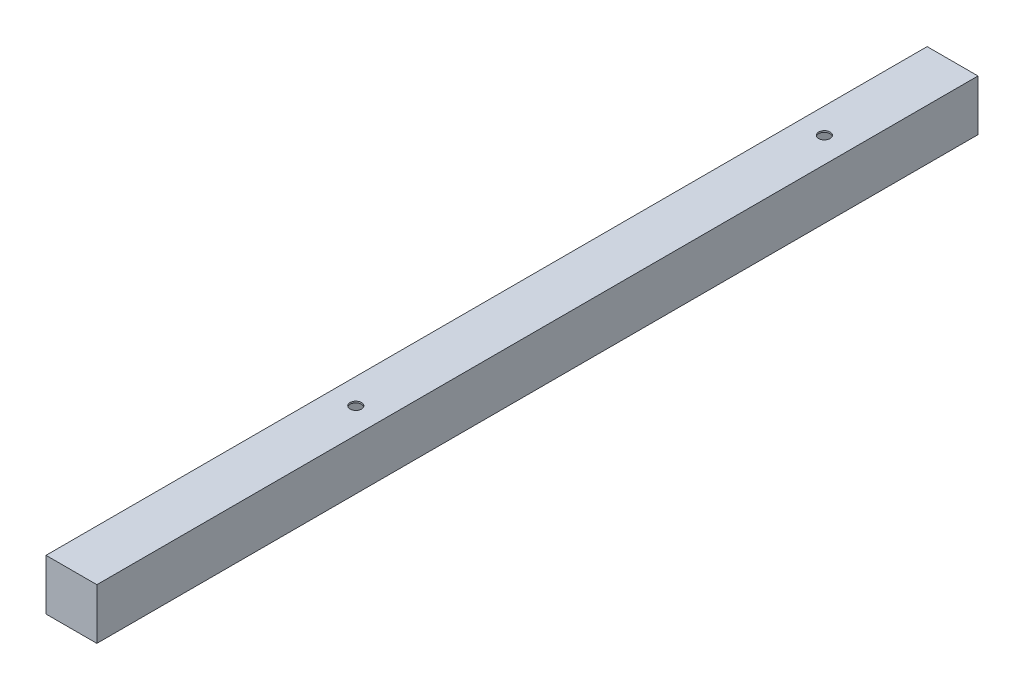
ISO-10303-21;
HEADER;
FILE_DESCRIPTION(('STEP AP214'),'2;1');
FILE_NAME('part.step','',(''),(''),'','','');
FILE_SCHEMA(('AUTOMOTIVE_DESIGN { 1 0 10303 214 1 1 1 1 }'));
ENDSEC;
DATA;
#1=APPLICATION_CONTEXT('core data for automotive mechanical design processes');
#2=APPLICATION_PROTOCOL_DEFINITION('international standard','automotive_design',2000,#1);
#3=PRODUCT_CONTEXT('',#1,'mechanical');
#4=PRODUCT('Part','Part','',(#3));
#5=PRODUCT_RELATED_PRODUCT_CATEGORY('part','',(#4));
#6=PRODUCT_DEFINITION_FORMATION('','',#4);
#7=PRODUCT_DEFINITION_CONTEXT('part definition',#1,'design');
#8=PRODUCT_DEFINITION('design','',#6,#7);
#9=PRODUCT_DEFINITION_SHAPE('','',#8);
#10=(LENGTH_UNIT() NAMED_UNIT(*) SI_UNIT(.MILLI.,.METRE.));
#11=(NAMED_UNIT(*) PLANE_ANGLE_UNIT() SI_UNIT($,.RADIAN.));
#12=(NAMED_UNIT(*) SI_UNIT($,.STERADIAN.) SOLID_ANGLE_UNIT());
#13=UNCERTAINTY_MEASURE_WITH_UNIT(LENGTH_MEASURE(1.E-05),#10,'distance_accuracy_value','');
#14=(GEOMETRIC_REPRESENTATION_CONTEXT(3) GLOBAL_UNCERTAINTY_ASSIGNED_CONTEXT((#13)) GLOBAL_UNIT_ASSIGNED_CONTEXT((#10,
#11,#12)) REPRESENTATION_CONTEXT('',''));
#15=CARTESIAN_POINT('',(0.,0.,0.));
#16=DIRECTION('',(0.,0.,1.));
#17=DIRECTION('',(1.,0.,0.));
#18=AXIS2_PLACEMENT_3D('',#15,#16,#17);
#19=CARTESIAN_POINT('',(0.,0.,2.));
#20=DIRECTION('',(0.,0.,-1.));
#21=DIRECTION('',(-1.,0.,0.));
#22=AXIS2_PLACEMENT_3D('',#19,#20,#21);
#23=PLANE('',#22);
#24=DIRECTION('',(0.,-1.,0.));
#25=VECTOR('',#24,1.);
#26=CARTESIAN_POINT('',(61.6,-1.9,2.));
#27=LINE('',#26,#25);
#28=CARTESIAN_POINT('',(61.6,-1.9,2.));
#29=VERTEX_POINT('',#28);
#30=CARTESIAN_POINT('',(61.6,-61.6,2.));
#31=VERTEX_POINT('',#30);
#32=EDGE_CURVE('E51',#29,#31,#27,.T.);
#33=ORIENTED_EDGE('',*,*,#32,.F.);
#34=DIRECTION('',(1.,0.,0.));
#35=VECTOR('',#34,1.);
#36=CARTESIAN_POINT('',(61.6,-1.9,2.));
#37=LINE('',#36,#35);
#38=CARTESIAN_POINT('',(1.9,-1.9,2.));
#39=VERTEX_POINT('',#38);
#40=EDGE_CURVE('E243',#39,#29,#37,.T.);
#41=ORIENTED_EDGE('',*,*,#40,.F.);
#42=DIRECTION('',(0.,1.,0.));
#43=VECTOR('',#42,1.);
#44=CARTESIAN_POINT('',(1.9,-1.9,2.));
#45=LINE('',#44,#43);
#46=CARTESIAN_POINT('',(1.9,-61.6,2.));
#47=VERTEX_POINT('',#46);
#48=EDGE_CURVE('E101',#47,#39,#45,.T.);
#49=ORIENTED_EDGE('',*,*,#48,.F.);
#50=DIRECTION('',(-1.,0.,0.));
#51=VECTOR('',#50,1.);
#52=CARTESIAN_POINT('',(61.6,-61.6,2.));
#53=LINE('',#52,#51);
#54=EDGE_CURVE('E99',#31,#47,#53,.T.);
#55=ORIENTED_EDGE('',*,*,#54,.F.);
#56=EDGE_LOOP('',(#33,#41,#49,#55));
#57=FACE_BOUND('',#56,.T.);
#58=ADVANCED_FACE('F35',(#57),#23,.F.);
#59=CARTESIAN_POINT('',(0.,0.,1098.));
#60=DIRECTION('',(0.,0.,1.));
#61=DIRECTION('',(1.,0.,0.));
#62=AXIS2_PLACEMENT_3D('',#59,#60,#61);
#63=PLANE('',#62);
#64=DIRECTION('',(0.,-1.,0.));
#65=VECTOR('',#64,1.);
#66=CARTESIAN_POINT('',(1.9,-1.9,1098.));
#67=LINE('',#66,#65);
#68=CARTESIAN_POINT('',(1.9,-1.9,1098.));
#69=VERTEX_POINT('',#68);
#70=CARTESIAN_POINT('',(1.9,-61.6,1098.));
#71=VERTEX_POINT('',#70);
#72=EDGE_CURVE('E59',#69,#71,#67,.T.);
#73=ORIENTED_EDGE('',*,*,#72,.F.);
#74=DIRECTION('',(-1.,0.,0.));
#75=VECTOR('',#74,1.);
#76=CARTESIAN_POINT('',(1.9,-1.9,1098.));
#77=LINE('',#76,#75);
#78=CARTESIAN_POINT('',(61.6,-1.9,1098.));
#79=VERTEX_POINT('',#78);
#80=EDGE_CURVE('E249',#79,#69,#77,.T.);
#81=ORIENTED_EDGE('',*,*,#80,.F.);
#82=DIRECTION('',(0.,1.,0.));
#83=VECTOR('',#82,1.);
#84=CARTESIAN_POINT('',(61.6,-1.9,1098.));
#85=LINE('',#84,#83);
#86=CARTESIAN_POINT('',(61.6,-61.6,1098.));
#87=VERTEX_POINT('',#86);
#88=EDGE_CURVE('E247',#87,#79,#85,.T.);
#89=ORIENTED_EDGE('',*,*,#88,.F.);
#90=DIRECTION('',(1.,0.,0.));
#91=VECTOR('',#90,1.);
#92=CARTESIAN_POINT('',(1.9,-61.6,1098.));
#93=LINE('',#92,#91);
#94=EDGE_CURVE('E119',#71,#87,#93,.T.);
#95=ORIENTED_EDGE('',*,*,#94,.F.);
#96=EDGE_LOOP('',(#73,#81,#89,#95));
#97=FACE_BOUND('',#96,.T.);
#98=ADVANCED_FACE('F185',(#97),#63,.F.);
#99=CARTESIAN_POINT('',(1.9,-1.9,1100.));
#100=DIRECTION('',(0.,-1.,0.));
#101=DIRECTION('',(0.,0.,-1.));
#102=AXIS2_PLACEMENT_3D('',#99,#100,#101);
#103=PLANE('',#102);
#104=CARTESIAN_POINT('',(31.7500000000001,-1.9,745.));
#105=DIRECTION('',(0.,-1.,0.));
#106=DIRECTION('',(0.,0.,-1.));
#107=AXIS2_PLACEMENT_3D('',#104,#105,#106);
#108=CIRCLE('',#107,7.14374999999999);
#109=CARTESIAN_POINT('',(31.7500000000001,-1.9,737.85625));
#110=VERTEX_POINT('',#109);
#111=EDGE_CURVE('E229',#110,#110,#108,.T.);
#112=ORIENTED_EDGE('',*,*,#111,.F.);
#113=EDGE_LOOP('',(#112));
#114=FACE_BOUND('',#113,.T.);
#115=CARTESIAN_POINT('',(31.75,-1.9,160.));
#116=DIRECTION('',(0.,-1.,0.));
#117=DIRECTION('',(0.,0.,-1.));
#118=AXIS2_PLACEMENT_3D('',#115,#116,#117);
#119=CIRCLE('',#118,7.14375);
#120=CARTESIAN_POINT('',(31.75,-1.9,152.85625));
#121=VERTEX_POINT('',#120);
#122=EDGE_CURVE('E232',#121,#121,#119,.T.);
#123=ORIENTED_EDGE('',*,*,#122,.F.);
#124=EDGE_LOOP('',(#123));
#125=FACE_BOUND('',#124,.T.);
#126=DIRECTION('',(0.,0.,-1.));
#127=VECTOR('',#126,1.);
#128=CARTESIAN_POINT('',(1.9,-1.9,1100.));
#129=LINE('',#128,#127);
#130=EDGE_CURVE('E124',#69,#39,#129,.T.);
#131=ORIENTED_EDGE('',*,*,#130,.T.);
#132=ORIENTED_EDGE('',*,*,#40,.T.);
#133=DIRECTION('',(0.,0.,-1.));
#134=VECTOR('',#133,1.);
#135=CARTESIAN_POINT('',(61.6,-1.9,1100.));
#136=LINE('',#135,#134);
#137=EDGE_CURVE('E114',#79,#29,#136,.T.);
#138=ORIENTED_EDGE('',*,*,#137,.F.);
#139=ORIENTED_EDGE('',*,*,#80,.T.);
#140=EDGE_LOOP('',(#131,#132,#138,#139));
#141=FACE_BOUND('',#140,.T.);
#142=ADVANCED_FACE('F191',(#114,#125,#141),#103,.T.);
#143=CARTESIAN_POINT('',(61.6,-1.9,1100.));
#144=DIRECTION('',(-1.,0.,0.));
#145=DIRECTION('',(0.,-1.,0.));
#146=AXIS2_PLACEMENT_3D('',#143,#144,#145);
#147=PLANE('',#146);
#148=ORIENTED_EDGE('',*,*,#137,.T.);
#149=ORIENTED_EDGE('',*,*,#32,.T.);
#150=DIRECTION('',(0.,0.,-1.));
#151=VECTOR('',#150,1.);
#152=CARTESIAN_POINT('',(61.6,-61.6,1100.));
#153=LINE('',#152,#151);
#154=EDGE_CURVE('E112',#87,#31,#153,.T.);
#155=ORIENTED_EDGE('',*,*,#154,.F.);
#156=ORIENTED_EDGE('',*,*,#88,.T.);
#157=EDGE_LOOP('',(#148,#149,#155,#156));
#158=FACE_BOUND('',#157,.T.);
#159=ADVANCED_FACE('F110',(#158),#147,.T.);
#160=CARTESIAN_POINT('',(1.90000000000001,-61.6,1100.));
#161=DIRECTION('',(0.,1.,0.));
#162=DIRECTION('',(0.,0.,1.));
#163=AXIS2_PLACEMENT_3D('',#160,#161,#162);
#164=PLANE('',#163);
#165=CARTESIAN_POINT('',(31.7500000000001,-61.6,745.));
#166=DIRECTION('',(0.,1.,0.));
#167=DIRECTION('',(0.,0.,1.));
#168=AXIS2_PLACEMENT_3D('',#165,#166,#167);
#169=CIRCLE('',#168,7.14374999999999);
#170=CARTESIAN_POINT('',(31.7500000000001,-61.6,752.14375));
#171=VERTEX_POINT('',#170);
#172=EDGE_CURVE('E234',#171,#171,#169,.T.);
#173=ORIENTED_EDGE('',*,*,#172,.F.);
#174=EDGE_LOOP('',(#173));
#175=FACE_BOUND('',#174,.T.);
#176=CARTESIAN_POINT('',(31.75,-61.6,160.));
#177=DIRECTION('',(0.,1.,0.));
#178=DIRECTION('',(0.,0.,1.));
#179=AXIS2_PLACEMENT_3D('',#176,#177,#178);
#180=CIRCLE('',#179,7.14375);
#181=CARTESIAN_POINT('',(31.75,-61.6,167.14375));
#182=VERTEX_POINT('',#181);
#183=EDGE_CURVE('E39',#182,#182,#180,.T.);
#184=ORIENTED_EDGE('',*,*,#183,.F.);
#185=EDGE_LOOP('',(#184));
#186=FACE_BOUND('',#185,.T.);
#187=ORIENTED_EDGE('',*,*,#154,.T.);
#188=ORIENTED_EDGE('',*,*,#54,.T.);
#189=DIRECTION('',(0.,0.,-1.));
#190=VECTOR('',#189,1.);
#191=CARTESIAN_POINT('',(1.90000000000001,-61.6,1100.));
#192=LINE('',#191,#190);
#193=EDGE_CURVE('E120',#71,#47,#192,.T.);
#194=ORIENTED_EDGE('',*,*,#193,.F.);
#195=ORIENTED_EDGE('',*,*,#94,.T.);
#196=EDGE_LOOP('',(#187,#188,#194,#195));
#197=FACE_BOUND('',#196,.T.);
#198=ADVANCED_FACE('F118',(#175,#186,#197),#164,.T.);
#199=CARTESIAN_POINT('',(1.9,-1.9,1100.));
#200=DIRECTION('',(1.,0.,0.));
#201=DIRECTION('',(0.,1.,0.));
#202=AXIS2_PLACEMENT_3D('',#199,#200,#201);
#203=PLANE('',#202);
#204=ORIENTED_EDGE('',*,*,#193,.T.);
#205=ORIENTED_EDGE('',*,*,#48,.T.);
#206=ORIENTED_EDGE('',*,*,#130,.F.);
#207=ORIENTED_EDGE('',*,*,#72,.T.);
#208=EDGE_LOOP('',(#204,#205,#206,#207));
#209=FACE_BOUND('',#208,.T.);
#210=ADVANCED_FACE('F204',(#209),#203,.T.);
#211=CARTESIAN_POINT('',(31.75,-120.,160.));
#212=DIRECTION('',(0.,1.,0.));
#213=DIRECTION('',(0.,0.,1.));
#214=AXIS2_PLACEMENT_3D('',#211,#212,#213);
#215=CYLINDRICAL_SURFACE('',#214,7.14375);
#216=ORIENTED_EDGE('',*,*,#183,.T.);
#217=EDGE_LOOP('',(#216));
#218=FACE_BOUND('',#217,.T.);
#219=CARTESIAN_POINT('',(31.75,-63.5,160.));
#220=DIRECTION('',(0.,1.,0.));
#221=DIRECTION('',(0.,0.,1.));
#222=AXIS2_PLACEMENT_3D('',#219,#220,#221);
#223=CIRCLE('',#222,7.14375);
#224=CARTESIAN_POINT('',(31.75,-63.5,167.14375));
#225=VERTEX_POINT('',#224);
#226=EDGE_CURVE('E115',#225,#225,#223,.T.);
#227=ORIENTED_EDGE('',*,*,#226,.F.);
#228=EDGE_LOOP('',(#227));
#229=FACE_BOUND('',#228,.T.);
#230=ADVANCED_FACE('F194',(#218,#229),#215,.F.);
#231=ORIENTED_EDGE('',*,*,#122,.T.);
#232=EDGE_LOOP('',(#231));
#233=FACE_BOUND('',#232,.T.);
#234=CARTESIAN_POINT('',(31.75,0.,160.));
#235=DIRECTION('',(0.,1.,0.));
#236=DIRECTION('',(0.,0.,1.));
#237=AXIS2_PLACEMENT_3D('',#234,#235,#236);
#238=CIRCLE('',#237,7.14375);
#239=CARTESIAN_POINT('',(31.75,0.,167.14375));
#240=VERTEX_POINT('',#239);
#241=EDGE_CURVE('E227',#240,#240,#238,.T.);
#242=ORIENTED_EDGE('',*,*,#241,.T.);
#243=EDGE_LOOP('',(#242));
#244=FACE_BOUND('',#243,.T.);
#245=ADVANCED_FACE('F211',(#233,#244),#215,.F.);
#246=CARTESIAN_POINT('',(0.,0.,1100.));
#247=DIRECTION('',(0.,0.,1.));
#248=DIRECTION('',(1.,0.,0.));
#249=AXIS2_PLACEMENT_3D('',#246,#247,#248);
#250=PLANE('',#249);
#251=DIRECTION('',(0.,-1.,0.));
#252=VECTOR('',#251,1.);
#253=CARTESIAN_POINT('',(0.,0.,1100.));
#254=LINE('',#253,#252);
#255=CARTESIAN_POINT('',(0.,0.,1100.));
#256=VERTEX_POINT('',#255);
#257=CARTESIAN_POINT('',(0.,-63.5,1100.));
#258=VERTEX_POINT('',#257);
#259=EDGE_CURVE('E128',#256,#258,#254,.T.);
#260=ORIENTED_EDGE('',*,*,#259,.T.);
#261=DIRECTION('',(1.,0.,0.));
#262=VECTOR('',#261,1.);
#263=CARTESIAN_POINT('',(0.,-63.5,1100.));
#264=LINE('',#263,#262);
#265=CARTESIAN_POINT('',(63.5,-63.5,1100.));
#266=VERTEX_POINT('',#265);
#267=EDGE_CURVE('E131',#258,#266,#264,.T.);
#268=ORIENTED_EDGE('',*,*,#267,.T.);
#269=DIRECTION('',(0.,1.,0.));
#270=VECTOR('',#269,1.);
#271=CARTESIAN_POINT('',(63.5,0.,1100.));
#272=LINE('',#271,#270);
#273=CARTESIAN_POINT('',(63.5,0.,1100.));
#274=VERTEX_POINT('',#273);
#275=EDGE_CURVE('E134',#266,#274,#272,.T.);
#276=ORIENTED_EDGE('',*,*,#275,.T.);
#277=DIRECTION('',(-1.,0.,0.));
#278=VECTOR('',#277,1.);
#279=CARTESIAN_POINT('',(0.,0.,1100.));
#280=LINE('',#279,#278);
#281=EDGE_CURVE('E136',#274,#256,#280,.T.);
#282=ORIENTED_EDGE('',*,*,#281,.T.);
#283=EDGE_LOOP('',(#260,#268,#276,#282));
#284=FACE_BOUND('',#283,.T.);
#285=ADVANCED_FACE('F171',(#284),#250,.T.);
#286=CARTESIAN_POINT('',(0.,0.,0.));
#287=DIRECTION('',(0.,0.,1.));
#288=DIRECTION('',(1.,0.,0.));
#289=AXIS2_PLACEMENT_3D('',#286,#287,#288);
#290=PLANE('',#289);
#291=DIRECTION('',(0.,-1.,0.));
#292=VECTOR('',#291,1.);
#293=CARTESIAN_POINT('',(0.,0.,0.));
#294=LINE('',#293,#292);
#295=CARTESIAN_POINT('',(0.,0.,0.));
#296=VERTEX_POINT('',#295);
#297=CARTESIAN_POINT('',(0.,-63.5,0.));
#298=VERTEX_POINT('',#297);
#299=EDGE_CURVE('E122',#296,#298,#294,.T.);
#300=ORIENTED_EDGE('',*,*,#299,.F.);
#301=DIRECTION('',(-1.,0.,0.));
#302=VECTOR('',#301,1.);
#303=CARTESIAN_POINT('',(0.,0.,0.));
#304=LINE('',#303,#302);
#305=CARTESIAN_POINT('',(63.5,0.,0.));
#306=VERTEX_POINT('',#305);
#307=EDGE_CURVE('E132',#306,#296,#304,.T.);
#308=ORIENTED_EDGE('',*,*,#307,.F.);
#309=DIRECTION('',(0.,1.,0.));
#310=VECTOR('',#309,1.);
#311=CARTESIAN_POINT('',(63.5,0.,0.));
#312=LINE('',#311,#310);
#313=CARTESIAN_POINT('',(63.5,-63.5,0.));
#314=VERTEX_POINT('',#313);
#315=EDGE_CURVE('E143',#314,#306,#312,.T.);
#316=ORIENTED_EDGE('',*,*,#315,.F.);
#317=DIRECTION('',(1.,0.,0.));
#318=VECTOR('',#317,1.);
#319=CARTESIAN_POINT('',(0.,-63.5,0.));
#320=LINE('',#319,#318);
#321=EDGE_CURVE('E141',#298,#314,#320,.T.);
#322=ORIENTED_EDGE('',*,*,#321,.F.);
#323=EDGE_LOOP('',(#300,#308,#316,#322));
#324=FACE_BOUND('',#323,.T.);
#325=ADVANCED_FACE('F162',(#324),#290,.F.);
#326=CARTESIAN_POINT('',(0.,0.,1100.));
#327=DIRECTION('',(1.,0.,0.));
#328=DIRECTION('',(0.,1.,0.));
#329=AXIS2_PLACEMENT_3D('',#326,#327,#328);
#330=PLANE('',#329);
#331=ORIENTED_EDGE('',*,*,#299,.T.);
#332=DIRECTION('',(0.,0.,-1.));
#333=VECTOR('',#332,1.);
#334=CARTESIAN_POINT('',(0.,-63.5,1100.));
#335=LINE('',#334,#333);
#336=EDGE_CURVE('E11',#258,#298,#335,.T.);
#337=ORIENTED_EDGE('',*,*,#336,.F.);
#338=ORIENTED_EDGE('',*,*,#259,.F.);
#339=DIRECTION('',(0.,0.,-1.));
#340=VECTOR('',#339,1.);
#341=CARTESIAN_POINT('',(0.,0.,1100.));
#342=LINE('',#341,#340);
#343=EDGE_CURVE('E138',#256,#296,#342,.T.);
#344=ORIENTED_EDGE('',*,*,#343,.T.);
#345=EDGE_LOOP('',(#331,#337,#338,#344));
#346=FACE_BOUND('',#345,.T.);
#347=ADVANCED_FACE('F37',(#346),#330,.F.);
#348=CARTESIAN_POINT('',(0.,-63.5,1100.));
#349=DIRECTION('',(0.,1.,0.));
#350=DIRECTION('',(0.,0.,1.));
#351=AXIS2_PLACEMENT_3D('',#348,#349,#350);
#352=PLANE('',#351);
#353=CARTESIAN_POINT('',(31.7500000000001,-63.5,745.));
#354=DIRECTION('',(0.,1.,0.));
#355=DIRECTION('',(0.,0.,1.));
#356=AXIS2_PLACEMENT_3D('',#353,#354,#355);
#357=CIRCLE('',#356,7.14374999999999);
#358=CARTESIAN_POINT('',(31.7500000000001,-63.5,752.14375));
#359=VERTEX_POINT('',#358);
#360=EDGE_CURVE('E363',#359,#359,#357,.T.);
#361=ORIENTED_EDGE('',*,*,#360,.T.);
#362=EDGE_LOOP('',(#361));
#363=FACE_BOUND('',#362,.T.);
#364=ORIENTED_EDGE('',*,*,#226,.T.);
#365=EDGE_LOOP('',(#364));
#366=FACE_BOUND('',#365,.T.);
#367=ORIENTED_EDGE('',*,*,#321,.T.);
#368=DIRECTION('',(0.,0.,-1.));
#369=VECTOR('',#368,1.);
#370=CARTESIAN_POINT('',(63.5,-63.5,1100.));
#371=LINE('',#370,#369);
#372=EDGE_CURVE('E44',#266,#314,#371,.T.);
#373=ORIENTED_EDGE('',*,*,#372,.F.);
#374=ORIENTED_EDGE('',*,*,#267,.F.);
#375=ORIENTED_EDGE('',*,*,#336,.T.);
#376=EDGE_LOOP('',(#367,#373,#374,#375));
#377=FACE_BOUND('',#376,.T.);
#378=ADVANCED_FACE('F172',(#363,#366,#377),#352,.F.);
#379=CARTESIAN_POINT('',(63.5,0.,1100.));
#380=DIRECTION('',(-1.,0.,0.));
#381=DIRECTION('',(0.,-1.,0.));
#382=AXIS2_PLACEMENT_3D('',#379,#380,#381);
#383=PLANE('',#382);
#384=ORIENTED_EDGE('',*,*,#315,.T.);
#385=DIRECTION('',(0.,0.,-1.));
#386=VECTOR('',#385,1.);
#387=CARTESIAN_POINT('',(63.5,0.,1100.));
#388=LINE('',#387,#386);
#389=EDGE_CURVE('E148',#274,#306,#388,.T.);
#390=ORIENTED_EDGE('',*,*,#389,.F.);
#391=ORIENTED_EDGE('',*,*,#275,.F.);
#392=ORIENTED_EDGE('',*,*,#372,.T.);
#393=EDGE_LOOP('',(#384,#390,#391,#392));
#394=FACE_BOUND('',#393,.T.);
#395=ADVANCED_FACE('F156',(#394),#383,.F.);
#396=CARTESIAN_POINT('',(0.,0.,1100.));
#397=DIRECTION('',(0.,-1.,0.));
#398=DIRECTION('',(0.,0.,-1.));
#399=AXIS2_PLACEMENT_3D('',#396,#397,#398);
#400=PLANE('',#399);
#401=CARTESIAN_POINT('',(31.7500000000001,0.,745.));
#402=DIRECTION('',(0.,1.,0.));
#403=DIRECTION('',(0.,0.,1.));
#404=AXIS2_PLACEMENT_3D('',#401,#402,#403);
#405=CIRCLE('',#404,7.14374999999999);
#406=CARTESIAN_POINT('',(31.7500000000001,0.,752.14375));
#407=VERTEX_POINT('',#406);
#408=EDGE_CURVE('E224',#407,#407,#405,.T.);
#409=ORIENTED_EDGE('',*,*,#408,.F.);
#410=EDGE_LOOP('',(#409));
#411=FACE_BOUND('',#410,.T.);
#412=ORIENTED_EDGE('',*,*,#241,.F.);
#413=EDGE_LOOP('',(#412));
#414=FACE_BOUND('',#413,.T.);
#415=ORIENTED_EDGE('',*,*,#307,.T.);
#416=ORIENTED_EDGE('',*,*,#343,.F.);
#417=ORIENTED_EDGE('',*,*,#281,.F.);
#418=ORIENTED_EDGE('',*,*,#389,.T.);
#419=EDGE_LOOP('',(#415,#416,#417,#418));
#420=FACE_BOUND('',#419,.T.);
#421=ADVANCED_FACE('F165',(#411,#414,#420),#400,.F.);
#422=CARTESIAN_POINT('',(31.7500000000001,-120.,745.));
#423=DIRECTION('',(0.,1.,0.));
#424=DIRECTION('',(0.,0.,1.));
#425=AXIS2_PLACEMENT_3D('',#422,#423,#424);
#426=CYLINDRICAL_SURFACE('',#425,7.14374999999999);
#427=ORIENTED_EDGE('',*,*,#111,.T.);
#428=EDGE_LOOP('',(#427));
#429=FACE_BOUND('',#428,.T.);
#430=ORIENTED_EDGE('',*,*,#408,.T.);
#431=EDGE_LOOP('',(#430));
#432=FACE_BOUND('',#431,.T.);
#433=ADVANCED_FACE('F214',(#429,#432),#426,.F.);
#434=ORIENTED_EDGE('',*,*,#172,.T.);
#435=EDGE_LOOP('',(#434));
#436=FACE_BOUND('',#435,.T.);
#437=ORIENTED_EDGE('',*,*,#360,.F.);
#438=EDGE_LOOP('',(#437));
#439=FACE_BOUND('',#438,.T.);
#440=ADVANCED_FACE('F219',(#436,#439),#426,.F.);
#441=CLOSED_SHELL('',(#58,#98,#142,#159,#198,#210,#230,#245,#285,#325,#347,#378,#395,#421,#433,#440));
#442=MANIFOLD_SOLID_BREP('B2',#441);
#443=ADVANCED_BREP_SHAPE_REPRESENTATION('',(#18,#442),#14);
#444=SHAPE_DEFINITION_REPRESENTATION(#9,#443);
ENDSEC;
END-ISO-10303-21;
